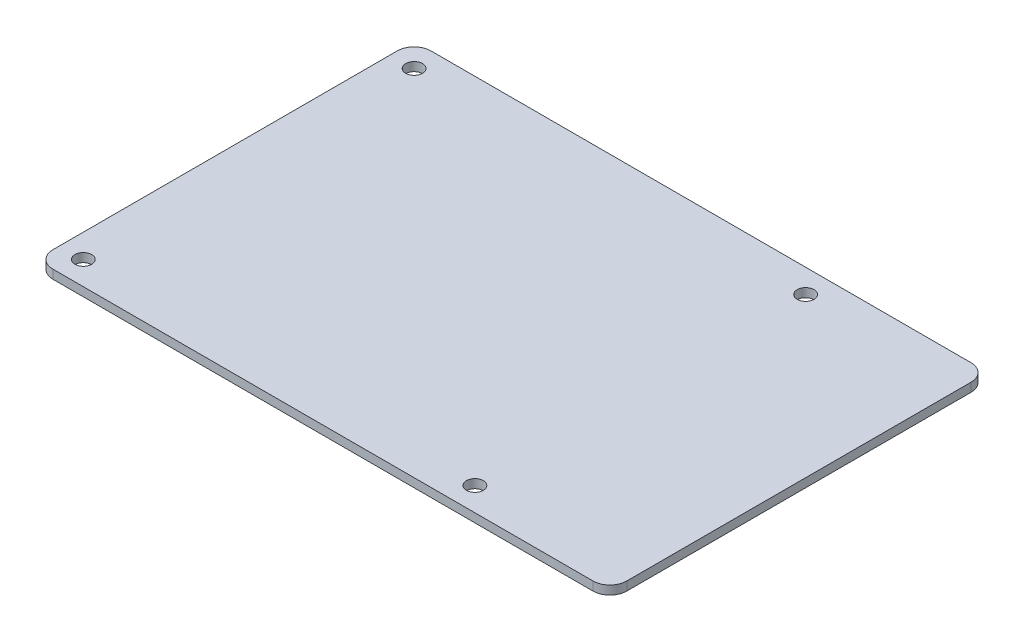
ISO-10303-21;
HEADER;
FILE_DESCRIPTION(('STEP AP214'),'2;1');
FILE_NAME('part.step','',(''),(''),'','','');
FILE_SCHEMA(('AUTOMOTIVE_DESIGN { 1 0 10303 214 1 1 1 1 }'));
ENDSEC;
DATA;
#1=APPLICATION_CONTEXT('core data for automotive mechanical design processes');
#2=APPLICATION_PROTOCOL_DEFINITION('international standard','automotive_design',2000,#1);
#3=PRODUCT_CONTEXT('',#1,'mechanical');
#4=PRODUCT('Part','Part','',(#3));
#5=PRODUCT_RELATED_PRODUCT_CATEGORY('part','',(#4));
#6=PRODUCT_DEFINITION_FORMATION('','',#4);
#7=PRODUCT_DEFINITION_CONTEXT('part definition',#1,'design');
#8=PRODUCT_DEFINITION('design','',#6,#7);
#9=PRODUCT_DEFINITION_SHAPE('','',#8);
#10=(LENGTH_UNIT() NAMED_UNIT(*) SI_UNIT(.MILLI.,.METRE.));
#11=(NAMED_UNIT(*) PLANE_ANGLE_UNIT() SI_UNIT($,.RADIAN.));
#12=(NAMED_UNIT(*) SI_UNIT($,.STERADIAN.) SOLID_ANGLE_UNIT());
#13=UNCERTAINTY_MEASURE_WITH_UNIT(LENGTH_MEASURE(1.E-05),#10,'distance_accuracy_value','');
#14=(GEOMETRIC_REPRESENTATION_CONTEXT(3) GLOBAL_UNCERTAINTY_ASSIGNED_CONTEXT((#13)) GLOBAL_UNIT_ASSIGNED_CONTEXT((#10,
#11,#12)) REPRESENTATION_CONTEXT('',''));
#15=CARTESIAN_POINT('',(0.,0.,0.));
#16=DIRECTION('',(0.,0.,1.));
#17=DIRECTION('',(1.,0.,0.));
#18=AXIS2_PLACEMENT_3D('',#15,#16,#17);
#19=CARTESIAN_POINT('',(39.9999999999725,-1.3,25.5000000000432));
#20=DIRECTION('',(0.,1.,0.));
#21=DIRECTION('',(0.,0.,1.));
#22=AXIS2_PLACEMENT_3D('',#19,#20,#21);
#23=CYLINDRICAL_SURFACE('',#22,2.50000000000001);
#24=CARTESIAN_POINT('',(39.9999999999725,0.,25.5000000000432));
#25=DIRECTION('',(0.,1.,0.));
#26=DIRECTION('',(0.,0.,1.));
#27=AXIS2_PLACEMENT_3D('',#24,#25,#26);
#28=CIRCLE('',#27,2.50000000000001);
#29=CARTESIAN_POINT('',(39.9999999999698,0.,28.0000000000432));
#30=VERTEX_POINT('',#29);
#31=CARTESIAN_POINT('',(42.4999999999725,0.,25.5000000000459));
#32=VERTEX_POINT('',#31);
#33=EDGE_CURVE('E129',#30,#32,#28,.T.);
#34=ORIENTED_EDGE('',*,*,#33,.F.);
#35=DIRECTION('',(0.,1.,0.));
#36=VECTOR('',#35,1.);
#37=CARTESIAN_POINT('',(39.9999999999698,-1.3,28.0000000000432));
#38=LINE('',#37,#36);
#39=CARTESIAN_POINT('',(39.9999999999698,-1.3,28.0000000000432));
#40=VERTEX_POINT('',#39);
#41=EDGE_CURVE('E11',#40,#30,#38,.T.);
#42=ORIENTED_EDGE('',*,*,#41,.F.);
#43=CARTESIAN_POINT('',(39.9999999999725,-1.3,25.5000000000432));
#44=DIRECTION('',(0.,1.,0.));
#45=DIRECTION('',(0.,0.,1.));
#46=AXIS2_PLACEMENT_3D('',#43,#44,#45);
#47=CIRCLE('',#46,2.50000000000001);
#48=CARTESIAN_POINT('',(42.4999999999725,-1.3,25.5000000000459));
#49=VERTEX_POINT('',#48);
#50=EDGE_CURVE('E150',#40,#49,#47,.T.);
#51=ORIENTED_EDGE('',*,*,#50,.T.);
#52=DIRECTION('',(0.,1.,0.));
#53=VECTOR('',#52,1.);
#54=CARTESIAN_POINT('',(42.4999999999725,-1.3,25.5000000000459));
#55=LINE('',#54,#53);
#56=EDGE_CURVE('E35',#49,#32,#55,.T.);
#57=ORIENTED_EDGE('',*,*,#56,.T.);
#58=EDGE_LOOP('',(#34,#42,#51,#57));
#59=FACE_BOUND('',#58,.T.);
#60=ADVANCED_FACE('F32',(#59),#23,.T.);
#61=CARTESIAN_POINT('',(-40.0000000000302,-1.3,27.9999999999568));
#62=DIRECTION('',(-1.07938831483967E-12,0.,1.));
#63=DIRECTION('',(1.,0.,1.07938831483967E-12));
#64=AXIS2_PLACEMENT_3D('',#61,#62,#63);
#65=PLANE('',#64);
#66=DIRECTION('',(1.,0.,1.07938831483967E-12));
#67=VECTOR('',#66,1.);
#68=CARTESIAN_POINT('',(-40.0000000000302,0.,27.9999999999568));
#69=LINE('',#68,#67);
#70=CARTESIAN_POINT('',(-40.0000000000302,0.,27.9999999999568));
#71=VERTEX_POINT('',#70);
#72=EDGE_CURVE('E148',#71,#30,#69,.T.);
#73=ORIENTED_EDGE('',*,*,#72,.F.);
#74=DIRECTION('',(0.,1.,0.));
#75=VECTOR('',#74,1.);
#76=CARTESIAN_POINT('',(-40.0000000000302,-1.3,27.9999999999568));
#77=LINE('',#76,#75);
#78=CARTESIAN_POINT('',(-40.0000000000302,-1.3,27.9999999999568));
#79=VERTEX_POINT('',#78);
#80=EDGE_CURVE('E41',#79,#71,#77,.T.);
#81=ORIENTED_EDGE('',*,*,#80,.F.);
#82=DIRECTION('',(1.,0.,1.07938831483967E-12));
#83=VECTOR('',#82,1.);
#84=CARTESIAN_POINT('',(-40.0000000000302,-1.3,27.9999999999568));
#85=LINE('',#84,#83);
#86=EDGE_CURVE('E119',#79,#40,#85,.T.);
#87=ORIENTED_EDGE('',*,*,#86,.T.);
#88=ORIENTED_EDGE('',*,*,#41,.T.);
#89=EDGE_LOOP('',(#73,#81,#87,#88));
#90=FACE_BOUND('',#89,.T.);
#91=ADVANCED_FACE('F162',(#90),#65,.T.);
#92=CARTESIAN_POINT('',(-40.0000000000275,-1.3,25.4999999999568));
#93=DIRECTION('',(0.,1.,0.));
#94=DIRECTION('',(0.,0.,1.));
#95=AXIS2_PLACEMENT_3D('',#92,#93,#94);
#96=CYLINDRICAL_SURFACE('',#95,2.50000000000001);
#97=CARTESIAN_POINT('',(-40.0000000000275,0.,25.4999999999568));
#98=DIRECTION('',(0.,1.,0.));
#99=DIRECTION('',(0.,0.,1.));
#100=AXIS2_PLACEMENT_3D('',#97,#98,#99);
#101=CIRCLE('',#100,2.50000000000001);
#102=CARTESIAN_POINT('',(-42.5000000000275,0.,25.4999999999541));
#103=VERTEX_POINT('',#102);
#104=EDGE_CURVE('E106',#103,#71,#101,.T.);
#105=ORIENTED_EDGE('',*,*,#104,.F.);
#106=DIRECTION('',(0.,1.,0.));
#107=VECTOR('',#106,1.);
#108=CARTESIAN_POINT('',(-42.5000000000275,-1.3,25.4999999999541));
#109=LINE('',#108,#107);
#110=CARTESIAN_POINT('',(-42.5000000000275,-1.3,25.4999999999541));
#111=VERTEX_POINT('',#110);
#112=EDGE_CURVE('E101',#111,#103,#109,.T.);
#113=ORIENTED_EDGE('',*,*,#112,.F.);
#114=CARTESIAN_POINT('',(-40.0000000000275,-1.3,25.4999999999568));
#115=DIRECTION('',(0.,1.,0.));
#116=DIRECTION('',(0.,0.,1.));
#117=AXIS2_PLACEMENT_3D('',#114,#115,#116);
#118=CIRCLE('',#117,2.50000000000001);
#119=EDGE_CURVE('E104',#111,#79,#118,.T.);
#120=ORIENTED_EDGE('',*,*,#119,.T.);
#121=ORIENTED_EDGE('',*,*,#80,.T.);
#122=EDGE_LOOP('',(#105,#113,#120,#121));
#123=FACE_BOUND('',#122,.T.);
#124=ADVANCED_FACE('F103',(#123),#96,.T.);
#125=CARTESIAN_POINT('',(-42.4999999999725,-1.3,-25.5000000000458));
#126=DIRECTION('',(-1.,0.,-1.07933814391561E-12));
#127=DIRECTION('',(-1.07933814391561E-12,0.,1.));
#128=AXIS2_PLACEMENT_3D('',#125,#126,#127);
#129=PLANE('',#128);
#130=DIRECTION('',(-1.07933814391561E-12,0.,1.));
#131=VECTOR('',#130,1.);
#132=CARTESIAN_POINT('',(-42.4999999999725,0.,-25.5000000000458));
#133=LINE('',#132,#131);
#134=CARTESIAN_POINT('',(-42.4999999999725,0.,-25.5000000000458));
#135=VERTEX_POINT('',#134);
#136=EDGE_CURVE('E145',#135,#103,#133,.T.);
#137=ORIENTED_EDGE('',*,*,#136,.F.);
#138=DIRECTION('',(0.,1.,0.));
#139=VECTOR('',#138,1.);
#140=CARTESIAN_POINT('',(-42.4999999999725,-1.3,-25.5000000000458));
#141=LINE('',#140,#139);
#142=CARTESIAN_POINT('',(-42.4999999999725,-1.3,-25.5000000000458));
#143=VERTEX_POINT('',#142);
#144=EDGE_CURVE('E111',#143,#135,#141,.T.);
#145=ORIENTED_EDGE('',*,*,#144,.F.);
#146=DIRECTION('',(-1.07933814391561E-12,0.,1.));
#147=VECTOR('',#146,1.);
#148=CARTESIAN_POINT('',(-42.4999999999725,-1.3,-25.5000000000458));
#149=LINE('',#148,#147);
#150=EDGE_CURVE('E117',#143,#111,#149,.T.);
#151=ORIENTED_EDGE('',*,*,#150,.T.);
#152=ORIENTED_EDGE('',*,*,#112,.T.);
#153=EDGE_LOOP('',(#137,#145,#151,#152));
#154=FACE_BOUND('',#153,.T.);
#155=ADVANCED_FACE('F121',(#154),#129,.T.);
#156=CARTESIAN_POINT('',(-39.9999999999725,-1.3,-25.5000000000431));
#157=DIRECTION('',(0.,1.,0.));
#158=DIRECTION('',(0.,0.,1.));
#159=AXIS2_PLACEMENT_3D('',#156,#157,#158);
#160=CYLINDRICAL_SURFACE('',#159,2.5);
#161=CARTESIAN_POINT('',(-39.9999999999725,0.,-25.5000000000431));
#162=DIRECTION('',(0.,1.,0.));
#163=DIRECTION('',(0.,0.,1.));
#164=AXIS2_PLACEMENT_3D('',#161,#162,#163);
#165=CIRCLE('',#164,2.5);
#166=CARTESIAN_POINT('',(-39.9999999999698,0.,-28.0000000000432));
#167=VERTEX_POINT('',#166);
#168=EDGE_CURVE('E142',#167,#135,#165,.T.);
#169=ORIENTED_EDGE('',*,*,#168,.F.);
#170=DIRECTION('',(0.,1.,0.));
#171=VECTOR('',#170,1.);
#172=CARTESIAN_POINT('',(-39.9999999999698,-1.3,-28.0000000000432));
#173=LINE('',#172,#171);
#174=CARTESIAN_POINT('',(-39.9999999999698,-1.3,-28.0000000000432));
#175=VERTEX_POINT('',#174);
#176=EDGE_CURVE('E154',#175,#167,#173,.T.);
#177=ORIENTED_EDGE('',*,*,#176,.F.);
#178=CARTESIAN_POINT('',(-39.9999999999725,-1.3,-25.5000000000431));
#179=DIRECTION('',(0.,1.,0.));
#180=DIRECTION('',(0.,0.,1.));
#181=AXIS2_PLACEMENT_3D('',#178,#179,#180);
#182=CIRCLE('',#181,2.5);
#183=EDGE_CURVE('E122',#175,#143,#182,.T.);
#184=ORIENTED_EDGE('',*,*,#183,.T.);
#185=ORIENTED_EDGE('',*,*,#144,.T.);
#186=EDGE_LOOP('',(#169,#177,#184,#185));
#187=FACE_BOUND('',#186,.T.);
#188=ADVANCED_FACE('F175',(#187),#160,.T.);
#189=CARTESIAN_POINT('',(40.0000000000302,-1.3,-27.9999999999568));
#190=DIRECTION('',(1.07908473823137E-12,0.,-1.));
#191=DIRECTION('',(-1.,0.,-1.07908473823137E-12));
#192=AXIS2_PLACEMENT_3D('',#189,#190,#191);
#193=PLANE('',#192);
#194=DIRECTION('',(-1.,0.,-1.07908473823137E-12));
#195=VECTOR('',#194,1.);
#196=CARTESIAN_POINT('',(40.0000000000302,0.,-27.9999999999568));
#197=LINE('',#196,#195);
#198=CARTESIAN_POINT('',(40.0000000000302,0.,-27.9999999999568));
#199=VERTEX_POINT('',#198);
#200=EDGE_CURVE('E139',#199,#167,#197,.T.);
#201=ORIENTED_EDGE('',*,*,#200,.F.);
#202=DIRECTION('',(0.,1.,0.));
#203=VECTOR('',#202,1.);
#204=CARTESIAN_POINT('',(40.0000000000302,-1.3,-27.9999999999568));
#205=LINE('',#204,#203);
#206=CARTESIAN_POINT('',(40.0000000000302,-1.3,-27.9999999999568));
#207=VERTEX_POINT('',#206);
#208=EDGE_CURVE('E156',#207,#199,#205,.T.);
#209=ORIENTED_EDGE('',*,*,#208,.F.);
#210=DIRECTION('',(-1.,0.,-1.07908473823137E-12));
#211=VECTOR('',#210,1.);
#212=CARTESIAN_POINT('',(40.0000000000302,-1.3,-27.9999999999568));
#213=LINE('',#212,#211);
#214=EDGE_CURVE('E124',#207,#175,#213,.T.);
#215=ORIENTED_EDGE('',*,*,#214,.T.);
#216=ORIENTED_EDGE('',*,*,#176,.T.);
#217=EDGE_LOOP('',(#201,#209,#215,#216));
#218=FACE_BOUND('',#217,.T.);
#219=ADVANCED_FACE('F178',(#218),#193,.T.);
#220=CARTESIAN_POINT('',(40.0000000000275,-1.3,-25.4999999999568));
#221=DIRECTION('',(0.,1.,0.));
#222=DIRECTION('',(0.,0.,1.));
#223=AXIS2_PLACEMENT_3D('',#220,#221,#222);
#224=CYLINDRICAL_SURFACE('',#223,2.5);
#225=CARTESIAN_POINT('',(40.0000000000275,0.,-25.4999999999568));
#226=DIRECTION('',(0.,1.,0.));
#227=DIRECTION('',(0.,0.,1.));
#228=AXIS2_PLACEMENT_3D('',#225,#226,#227);
#229=CIRCLE('',#228,2.5);
#230=CARTESIAN_POINT('',(42.5000000000275,0.,-25.4999999999541));
#231=VERTEX_POINT('',#230);
#232=EDGE_CURVE('E136',#231,#199,#229,.T.);
#233=ORIENTED_EDGE('',*,*,#232,.F.);
#234=DIRECTION('',(0.,1.,0.));
#235=VECTOR('',#234,1.);
#236=CARTESIAN_POINT('',(42.5000000000275,-1.3,-25.4999999999541));
#237=LINE('',#236,#235);
#238=CARTESIAN_POINT('',(42.5000000000275,-1.3,-25.4999999999541));
#239=VERTEX_POINT('',#238);
#240=EDGE_CURVE('E157',#239,#231,#237,.T.);
#241=ORIENTED_EDGE('',*,*,#240,.F.);
#242=CARTESIAN_POINT('',(40.0000000000275,-1.3,-25.4999999999568));
#243=DIRECTION('',(0.,1.,0.));
#244=DIRECTION('',(0.,0.,1.));
#245=AXIS2_PLACEMENT_3D('',#242,#243,#244);
#246=CIRCLE('',#245,2.5);
#247=EDGE_CURVE('E244',#239,#207,#246,.T.);
#248=ORIENTED_EDGE('',*,*,#247,.T.);
#249=ORIENTED_EDGE('',*,*,#208,.T.);
#250=EDGE_LOOP('',(#233,#241,#248,#249));
#251=FACE_BOUND('',#250,.T.);
#252=ADVANCED_FACE('F182',(#251),#224,.T.);
#253=CARTESIAN_POINT('',(42.4999999999725,-1.3,25.5000000000459));
#254=DIRECTION('',(1.,0.,1.07920208717239E-12));
#255=DIRECTION('',(1.07920208717239E-12,0.,-1.));
#256=AXIS2_PLACEMENT_3D('',#253,#254,#255);
#257=PLANE('',#256);
#258=DIRECTION('',(1.07920208717239E-12,0.,-1.));
#259=VECTOR('',#258,1.);
#260=CARTESIAN_POINT('',(42.4999999999725,0.,25.5000000000459));
#261=LINE('',#260,#259);
#262=EDGE_CURVE('E132',#32,#231,#261,.T.);
#263=ORIENTED_EDGE('',*,*,#262,.F.);
#264=ORIENTED_EDGE('',*,*,#56,.F.);
#265=DIRECTION('',(1.07920208717239E-12,0.,-1.));
#266=VECTOR('',#265,1.);
#267=CARTESIAN_POINT('',(42.4999999999725,-1.3,25.5000000000459));
#268=LINE('',#267,#266);
#269=EDGE_CURVE('E242',#49,#239,#268,.T.);
#270=ORIENTED_EDGE('',*,*,#269,.T.);
#271=ORIENTED_EDGE('',*,*,#240,.T.);
#272=EDGE_LOOP('',(#263,#264,#270,#271));
#273=FACE_BOUND('',#272,.T.);
#274=ADVANCED_FACE('F159',(#273),#257,.T.);
#275=CARTESIAN_POINT('',(39.9999999999725,-1.3,25.5000000000432));
#276=DIRECTION('',(0.,1.,0.));
#277=DIRECTION('',(0.,0.,1.));
#278=AXIS2_PLACEMENT_3D('',#275,#276,#277);
#279=PLANE('',#278);
#280=CARTESIAN_POINT('',(18.9999999999601,-1.3,24.499999999993));
#281=DIRECTION('',(0.,1.,0.));
#282=DIRECTION('',(0.,0.,-1.));
#283=AXIS2_PLACEMENT_3D('',#280,#281,#282);
#284=CIRCLE('',#283,1.24999999998654);
#285=CARTESIAN_POINT('',(18.9999999999601,-1.3,23.2500000000064));
#286=VERTEX_POINT('',#285);
#287=EDGE_CURVE('E217',#286,#286,#284,.T.);
#288=ORIENTED_EDGE('',*,*,#287,.T.);
#289=EDGE_LOOP('',(#288));
#290=FACE_BOUND('',#289,.T.);
#291=CARTESIAN_POINT('',(-39.0000000000399,-1.3,24.4999999999304));
#292=DIRECTION('',(0.,1.,0.));
#293=DIRECTION('',(0.,0.,-1.));
#294=AXIS2_PLACEMENT_3D('',#291,#292,#293);
#295=CIRCLE('',#294,1.24999999998655);
#296=CARTESIAN_POINT('',(-39.0000000000399,-1.3,23.2499999999438));
#297=VERTEX_POINT('',#296);
#298=EDGE_CURVE('E225',#297,#297,#295,.T.);
#299=ORIENTED_EDGE('',*,*,#298,.T.);
#300=EDGE_LOOP('',(#299));
#301=FACE_BOUND('',#300,.T.);
#302=CARTESIAN_POINT('',(-38.999999999987,-1.3,-24.5000000000555));
#303=DIRECTION('',(0.,1.,0.));
#304=DIRECTION('',(0.,0.,-1.));
#305=AXIS2_PLACEMENT_3D('',#302,#303,#304);
#306=CIRCLE('',#305,1.24999999998659);
#307=CARTESIAN_POINT('',(-38.999999999987,-1.3,-25.7500000000421));
#308=VERTEX_POINT('',#307);
#309=EDGE_CURVE('E231',#308,#308,#306,.T.);
#310=ORIENTED_EDGE('',*,*,#309,.T.);
#311=EDGE_LOOP('',(#310));
#312=FACE_BOUND('',#311,.T.);
#313=CARTESIAN_POINT('',(19.000000000013,-1.3,-24.499999999993));
#314=DIRECTION('',(0.,1.,0.));
#315=DIRECTION('',(0.,0.,-1.));
#316=AXIS2_PLACEMENT_3D('',#313,#314,#315);
#317=CIRCLE('',#316,1.24999999998654);
#318=CARTESIAN_POINT('',(19.000000000013,-1.3,-25.7499999999795));
#319=VERTEX_POINT('',#318);
#320=EDGE_CURVE('E133',#319,#319,#317,.T.);
#321=ORIENTED_EDGE('',*,*,#320,.T.);
#322=EDGE_LOOP('',(#321));
#323=FACE_BOUND('',#322,.T.);
#324=ORIENTED_EDGE('',*,*,#50,.F.);
#325=ORIENTED_EDGE('',*,*,#86,.F.);
#326=ORIENTED_EDGE('',*,*,#119,.F.);
#327=ORIENTED_EDGE('',*,*,#150,.F.);
#328=ORIENTED_EDGE('',*,*,#183,.F.);
#329=ORIENTED_EDGE('',*,*,#214,.F.);
#330=ORIENTED_EDGE('',*,*,#247,.F.);
#331=ORIENTED_EDGE('',*,*,#269,.F.);
#332=EDGE_LOOP('',(#324,#325,#326,#327,#328,#329,#330,#331));
#333=FACE_BOUND('',#332,.T.);
#334=ADVANCED_FACE('F115',(#290,#301,#312,#323,#333),#279,.F.);
#335=CARTESIAN_POINT('',(39.9999999999725,0.,25.5000000000432));
#336=DIRECTION('',(0.,1.,0.));
#337=DIRECTION('',(0.,0.,1.));
#338=AXIS2_PLACEMENT_3D('',#335,#336,#337);
#339=PLANE('',#338);
#340=CARTESIAN_POINT('',(18.9999999999601,0.,24.499999999993));
#341=DIRECTION('',(0.,1.,0.));
#342=DIRECTION('',(0.,0.,-1.));
#343=AXIS2_PLACEMENT_3D('',#340,#341,#342);
#344=CIRCLE('',#343,1.24999999998654);
#345=CARTESIAN_POINT('',(18.9999999999601,0.,23.2500000000064));
#346=VERTEX_POINT('',#345);
#347=EDGE_CURVE('E220',#346,#346,#344,.T.);
#348=ORIENTED_EDGE('',*,*,#347,.F.);
#349=EDGE_LOOP('',(#348));
#350=FACE_BOUND('',#349,.T.);
#351=CARTESIAN_POINT('',(-39.0000000000399,0.,24.4999999999304));
#352=DIRECTION('',(0.,1.,0.));
#353=DIRECTION('',(0.,0.,-1.));
#354=AXIS2_PLACEMENT_3D('',#351,#352,#353);
#355=CIRCLE('',#354,1.24999999998655);
#356=CARTESIAN_POINT('',(-39.0000000000399,0.,23.2499999999438));
#357=VERTEX_POINT('',#356);
#358=EDGE_CURVE('E222',#357,#357,#355,.T.);
#359=ORIENTED_EDGE('',*,*,#358,.F.);
#360=EDGE_LOOP('',(#359));
#361=FACE_BOUND('',#360,.T.);
#362=CARTESIAN_POINT('',(-38.999999999987,0.,-24.5000000000555));
#363=DIRECTION('',(0.,1.,0.));
#364=DIRECTION('',(0.,0.,-1.));
#365=AXIS2_PLACEMENT_3D('',#362,#363,#364);
#366=CIRCLE('',#365,1.24999999998659);
#367=CARTESIAN_POINT('',(-38.999999999987,0.,-25.7500000000421));
#368=VERTEX_POINT('',#367);
#369=EDGE_CURVE('E228',#368,#368,#366,.T.);
#370=ORIENTED_EDGE('',*,*,#369,.F.);
#371=EDGE_LOOP('',(#370));
#372=FACE_BOUND('',#371,.T.);
#373=CARTESIAN_POINT('',(19.000000000013,0.,-24.499999999993));
#374=DIRECTION('',(0.,1.,0.));
#375=DIRECTION('',(0.,0.,-1.));
#376=AXIS2_PLACEMENT_3D('',#373,#374,#375);
#377=CIRCLE('',#376,1.24999999998654);
#378=CARTESIAN_POINT('',(19.000000000013,0.,-25.7499999999795));
#379=VERTEX_POINT('',#378);
#380=EDGE_CURVE('E234',#379,#379,#377,.T.);
#381=ORIENTED_EDGE('',*,*,#380,.F.);
#382=EDGE_LOOP('',(#381));
#383=FACE_BOUND('',#382,.T.);
#384=ORIENTED_EDGE('',*,*,#33,.T.);
#385=ORIENTED_EDGE('',*,*,#262,.T.);
#386=ORIENTED_EDGE('',*,*,#232,.T.);
#387=ORIENTED_EDGE('',*,*,#200,.T.);
#388=ORIENTED_EDGE('',*,*,#168,.T.);
#389=ORIENTED_EDGE('',*,*,#136,.T.);
#390=ORIENTED_EDGE('',*,*,#104,.T.);
#391=ORIENTED_EDGE('',*,*,#72,.T.);
#392=EDGE_LOOP('',(#384,#385,#386,#387,#388,#389,#390,#391));
#393=FACE_BOUND('',#392,.T.);
#394=ADVANCED_FACE('F161',(#350,#361,#372,#383,#393),#339,.T.);
#395=CARTESIAN_POINT('',(19.000000000013,-1.3,-24.499999999993));
#396=DIRECTION('',(0.,1.,0.));
#397=DIRECTION('',(0.,0.,1.));
#398=AXIS2_PLACEMENT_3D('',#395,#396,#397);
#399=CYLINDRICAL_SURFACE('',#398,1.24999999998654);
#400=ORIENTED_EDGE('',*,*,#320,.F.);
#401=EDGE_LOOP('',(#400));
#402=FACE_BOUND('',#401,.T.);
#403=ORIENTED_EDGE('',*,*,#380,.T.);
#404=EDGE_LOOP('',(#403));
#405=FACE_BOUND('',#404,.T.);
#406=ADVANCED_FACE('F194',(#402,#405),#399,.F.);
#407=CARTESIAN_POINT('',(-38.999999999987,-1.3,-24.5000000000555));
#408=DIRECTION('',(0.,1.,0.));
#409=DIRECTION('',(0.,0.,1.));
#410=AXIS2_PLACEMENT_3D('',#407,#408,#409);
#411=CYLINDRICAL_SURFACE('',#410,1.24999999998659);
#412=ORIENTED_EDGE('',*,*,#309,.F.);
#413=EDGE_LOOP('',(#412));
#414=FACE_BOUND('',#413,.T.);
#415=ORIENTED_EDGE('',*,*,#369,.T.);
#416=EDGE_LOOP('',(#415));
#417=FACE_BOUND('',#416,.T.);
#418=ADVANCED_FACE('F201',(#414,#417),#411,.F.);
#419=CARTESIAN_POINT('',(-39.0000000000399,-1.3,24.4999999999304));
#420=DIRECTION('',(0.,1.,0.));
#421=DIRECTION('',(0.,0.,1.));
#422=AXIS2_PLACEMENT_3D('',#419,#420,#421);
#423=CYLINDRICAL_SURFACE('',#422,1.24999999998655);
#424=ORIENTED_EDGE('',*,*,#298,.F.);
#425=EDGE_LOOP('',(#424));
#426=FACE_BOUND('',#425,.T.);
#427=ORIENTED_EDGE('',*,*,#358,.T.);
#428=EDGE_LOOP('',(#427));
#429=FACE_BOUND('',#428,.T.);
#430=ADVANCED_FACE('F205',(#426,#429),#423,.F.);
#431=CARTESIAN_POINT('',(18.9999999999601,-1.3,24.499999999993));
#432=DIRECTION('',(0.,1.,0.));
#433=DIRECTION('',(0.,0.,1.));
#434=AXIS2_PLACEMENT_3D('',#431,#432,#433);
#435=CYLINDRICAL_SURFACE('',#434,1.24999999998654);
#436=ORIENTED_EDGE('',*,*,#287,.F.);
#437=EDGE_LOOP('',(#436));
#438=FACE_BOUND('',#437,.T.);
#439=ORIENTED_EDGE('',*,*,#347,.T.);
#440=EDGE_LOOP('',(#439));
#441=FACE_BOUND('',#440,.T.);
#442=ADVANCED_FACE('F209',(#438,#441),#435,.F.);
#443=CLOSED_SHELL('',(#60,#91,#124,#155,#188,#219,#252,#274,#334,#394,#406,#418,#430,#442));
#444=MANIFOLD_SOLID_BREP('B2',#443);
#445=ADVANCED_BREP_SHAPE_REPRESENTATION('',(#18,#444),#14);
#446=SHAPE_DEFINITION_REPRESENTATION(#9,#445);
ENDSEC;
END-ISO-10303-21;
